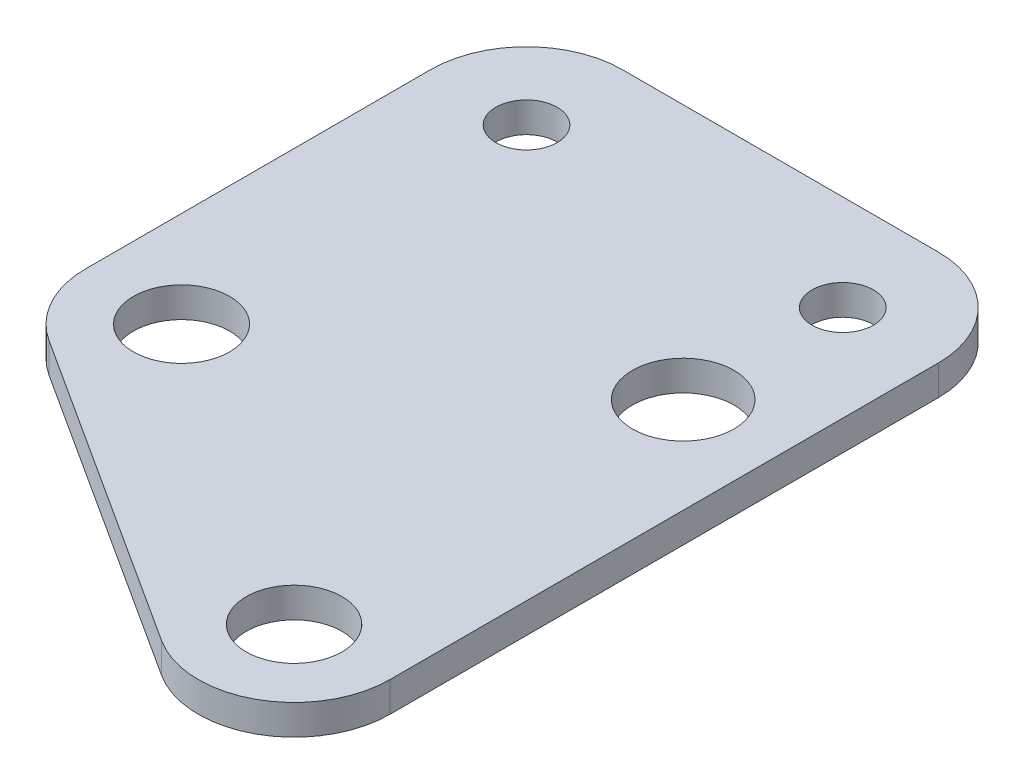
ISO-10303-21;
HEADER;
FILE_DESCRIPTION(('STEP AP214'),'2;1');
FILE_NAME('part.step','',(''),(''),'','','');
FILE_SCHEMA(('AUTOMOTIVE_DESIGN { 1 0 10303 214 1 1 1 1 }'));
ENDSEC;
DATA;
#1=APPLICATION_CONTEXT('core data for automotive mechanical design processes');
#2=APPLICATION_PROTOCOL_DEFINITION('international standard','automotive_design',2000,#1);
#3=PRODUCT_CONTEXT('',#1,'mechanical');
#4=PRODUCT('Part','Part','',(#3));
#5=PRODUCT_RELATED_PRODUCT_CATEGORY('part','',(#4));
#6=PRODUCT_DEFINITION_FORMATION('','',#4);
#7=PRODUCT_DEFINITION_CONTEXT('part definition',#1,'design');
#8=PRODUCT_DEFINITION('design','',#6,#7);
#9=PRODUCT_DEFINITION_SHAPE('','',#8);
#10=(LENGTH_UNIT() NAMED_UNIT(*) SI_UNIT(.MILLI.,.METRE.));
#11=(NAMED_UNIT(*) PLANE_ANGLE_UNIT() SI_UNIT($,.RADIAN.));
#12=(NAMED_UNIT(*) SI_UNIT($,.STERADIAN.) SOLID_ANGLE_UNIT());
#13=UNCERTAINTY_MEASURE_WITH_UNIT(LENGTH_MEASURE(1.E-05),#10,'distance_accuracy_value','');
#14=(GEOMETRIC_REPRESENTATION_CONTEXT(3) GLOBAL_UNCERTAINTY_ASSIGNED_CONTEXT((#13)) GLOBAL_UNIT_ASSIGNED_CONTEXT((#10,
#11,#12)) REPRESENTATION_CONTEXT('',''));
#15=CARTESIAN_POINT('',(0.,0.,0.));
#16=DIRECTION('',(0.,0.,1.));
#17=DIRECTION('',(1.,0.,0.));
#18=AXIS2_PLACEMENT_3D('',#15,#16,#17);
#19=CARTESIAN_POINT('',(0.,1.56999999999996,0.));
#20=DIRECTION('',(0.,-1.,0.));
#21=DIRECTION('',(1.,0.,0.));
#22=AXIS2_PLACEMENT_3D('',#19,#20,#21);
#23=PLANE('',#22);
#24=CARTESIAN_POINT('',(21.4999999999999,1.57000000000018,13.325));
#25=DIRECTION('',(0.,-1.,0.));
#26=DIRECTION('',(1.,0.,0.));
#27=AXIS2_PLACEMENT_3D('',#24,#25,#26);
#28=CIRCLE('',#27,2.65);
#29=CARTESIAN_POINT('',(24.1499999999999,1.57000000000018,13.325));
#30=VERTEX_POINT('',#29);
#31=EDGE_CURVE('E145',#30,#30,#28,.T.);
#32=ORIENTED_EDGE('',*,*,#31,.T.);
#33=EDGE_LOOP('',(#32));
#34=FACE_BOUND('',#33,.T.);
#35=CARTESIAN_POINT('',(4.99999999999978,1.57000000000007,5.00000000000006));
#36=DIRECTION('',(0.,-1.,0.));
#37=DIRECTION('',(1.,0.,0.));
#38=AXIS2_PLACEMENT_3D('',#35,#36,#37);
#39=CIRCLE('',#38,1.6);
#40=CARTESIAN_POINT('',(6.59999999999978,1.57000000000007,5.00000000000006));
#41=VERTEX_POINT('',#40);
#42=EDGE_CURVE('E19',#41,#41,#39,.T.);
#43=ORIENTED_EDGE('',*,*,#42,.T.);
#44=EDGE_LOOP('',(#43));
#45=FACE_BOUND('',#44,.T.);
#46=CARTESIAN_POINT('',(21.4999999999997,1.57000000000018,5.00000000000006));
#47=DIRECTION('',(0.,-1.,0.));
#48=DIRECTION('',(1.,0.,0.));
#49=AXIS2_PLACEMENT_3D('',#46,#47,#48);
#50=CIRCLE('',#49,1.6);
#51=CARTESIAN_POINT('',(23.0999999999997,1.57000000000018,5.00000000000006));
#52=VERTEX_POINT('',#51);
#53=EDGE_CURVE('E148',#52,#52,#50,.T.);
#54=ORIENTED_EDGE('',*,*,#53,.T.);
#55=EDGE_LOOP('',(#54));
#56=FACE_BOUND('',#55,.T.);
#57=CARTESIAN_POINT('',(4.99999999999978,1.57000000000007,23.0000000000001));
#58=DIRECTION('',(0.,-1.,0.));
#59=DIRECTION('',(1.,0.,0.));
#60=AXIS2_PLACEMENT_3D('',#57,#58,#59);
#61=CIRCLE('',#60,2.51);
#62=CARTESIAN_POINT('',(7.50999999999978,1.57000000000007,23.0000000000001));
#63=VERTEX_POINT('',#62);
#64=EDGE_CURVE('E115',#63,#63,#61,.T.);
#65=ORIENTED_EDGE('',*,*,#64,.T.);
#66=EDGE_LOOP('',(#65));
#67=FACE_BOUND('',#66,.T.);
#68=CARTESIAN_POINT('',(21.4999999999998,1.57000000000018,33.6250000000001));
#69=DIRECTION('',(0.,-1.,0.));
#70=DIRECTION('',(1.,0.,0.));
#71=AXIS2_PLACEMENT_3D('',#68,#69,#70);
#72=CIRCLE('',#71,2.5);
#73=CARTESIAN_POINT('',(23.9999999999998,1.57000000000018,33.6250000000001));
#74=VERTEX_POINT('',#73);
#75=EDGE_CURVE('E151',#74,#74,#72,.T.);
#76=ORIENTED_EDGE('',*,*,#75,.T.);
#77=EDGE_LOOP('',(#76));
#78=FACE_BOUND('',#77,.T.);
#79=CARTESIAN_POINT('',(21.4999999999998,1.57000000000018,5.00000000000006));
#80=DIRECTION('',(0.,-1.,0.));
#81=DIRECTION('',(1.,0.,0.));
#82=AXIS2_PLACEMENT_3D('',#79,#80,#81);
#83=CIRCLE('',#82,5.);
#84=CARTESIAN_POINT('',(21.4999999999998,1.57000000000018,0.));
#85=VERTEX_POINT('',#84);
#86=CARTESIAN_POINT('',(26.4999999999999,1.57000000000007,5.00000000000003));
#87=VERTEX_POINT('',#86);
#88=EDGE_CURVE('E79',#85,#87,#83,.T.);
#89=ORIENTED_EDGE('',*,*,#88,.F.);
#90=DIRECTION('',(1.,0.,0.));
#91=VECTOR('',#90,1.);
#92=CARTESIAN_POINT('',(0.,1.57000000000018,0.));
#93=LINE('',#92,#91);
#94=CARTESIAN_POINT('',(4.99999999999989,1.57000000000007,0.));
#95=VERTEX_POINT('',#94);
#96=EDGE_CURVE('E96',#85,#95,#93,.F.);
#97=ORIENTED_EDGE('',*,*,#96,.T.);
#98=CARTESIAN_POINT('',(4.99999999999978,1.56999999999996,5.00000000000006));
#99=DIRECTION('',(0.,-1.,0.));
#100=DIRECTION('',(1.,0.,0.));
#101=AXIS2_PLACEMENT_3D('',#98,#99,#100);
#102=CIRCLE('',#101,5.);
#103=CARTESIAN_POINT('',(-2.1987620058006E-13,1.56999999999996,5.00000000000005));
#104=VERTEX_POINT('',#103);
#105=EDGE_CURVE('E112',#104,#95,#102,.T.);
#106=ORIENTED_EDGE('',*,*,#105,.F.);
#107=DIRECTION('',(0.,0.,-1.));
#108=VECTOR('',#107,1.);
#109=CARTESIAN_POINT('',(-2.22044604925031E-13,1.56999999999996,25.7272727272728));
#110=LINE('',#109,#108);
#111=CARTESIAN_POINT('',(-2.21858910662035E-13,1.56999999999996,23.0000000000001));
#112=VERTEX_POINT('',#111);
#113=EDGE_CURVE('E109',#104,#112,#110,.F.);
#114=ORIENTED_EDGE('',*,*,#113,.T.);
#115=CARTESIAN_POINT('',(4.99999999999978,1.56999999999996,23.0000000000001));
#116=DIRECTION('',(0.,-1.,0.));
#117=DIRECTION('',(1.,0.,0.));
#118=AXIS2_PLACEMENT_3D('',#115,#116,#117);
#119=CIRCLE('',#118,5.);
#120=CARTESIAN_POINT('',(2.2929936305731,1.56999999999996,27.2038216560511));
#121=VERTEX_POINT('',#120);
#122=EDGE_CURVE('E117',#121,#112,#119,.T.);
#123=ORIENTED_EDGE('',*,*,#122,.F.);
#124=DIRECTION('',(-0.840764331210191,0.,-0.54140127388535));
#125=VECTOR('',#124,1.);
#126=CARTESIAN_POINT('',(26.4999999999998,1.56999999999996,42.7916666666667));
#127=LINE('',#126,#125);
#128=CARTESIAN_POINT('',(18.792993630573,1.56999999999996,37.828821656051));
#129=VERTEX_POINT('',#128);
#130=EDGE_CURVE('E116',#121,#129,#127,.F.);
#131=ORIENTED_EDGE('',*,*,#130,.T.);
#132=CARTESIAN_POINT('',(21.4999999999998,1.56999999999996,33.6250000000001));
#133=DIRECTION('',(0.,-1.,0.));
#134=DIRECTION('',(1.,0.,0.));
#135=AXIS2_PLACEMENT_3D('',#132,#133,#134);
#136=CIRCLE('',#135,5.);
#137=CARTESIAN_POINT('',(26.4999999999998,1.56999999999996,33.6250000000001));
#138=VERTEX_POINT('',#137);
#139=EDGE_CURVE('E84',#138,#129,#136,.T.);
#140=ORIENTED_EDGE('',*,*,#139,.F.);
#141=DIRECTION('',(0.,0.,1.));
#142=VECTOR('',#141,1.);
#143=CARTESIAN_POINT('',(26.4999999999999,1.56999999999996,0.));
#144=LINE('',#143,#142);
#145=EDGE_CURVE('E82',#138,#87,#144,.F.);
#146=ORIENTED_EDGE('',*,*,#145,.T.);
#147=EDGE_LOOP('',(#89,#97,#106,#114,#123,#131,#140,#146));
#148=FACE_BOUND('',#147,.T.);
#149=ADVANCED_FACE('F16',(#34,#45,#56,#67,#78,#148),#23,.F.);
#150=CARTESIAN_POINT('',(4.99999999999978,1.57000000000007,5.00000000000006));
#151=DIRECTION('',(0.,-1.,0.));
#152=DIRECTION('',(1.,0.,0.));
#153=AXIS2_PLACEMENT_3D('',#150,#151,#152);
#154=CYLINDRICAL_SURFACE('',#153,1.6);
#155=ORIENTED_EDGE('',*,*,#42,.F.);
#156=EDGE_LOOP('',(#155));
#157=FACE_BOUND('',#156,.T.);
#158=CARTESIAN_POINT('',(4.99999999999978,0.,5.00000000000006));
#159=DIRECTION('',(0.,-1.,0.));
#160=DIRECTION('',(1.,0.,0.));
#161=AXIS2_PLACEMENT_3D('',#158,#159,#160);
#162=CIRCLE('',#161,1.6);
#163=CARTESIAN_POINT('',(6.59999999999978,0.,5.00000000000006));
#164=VERTEX_POINT('',#163);
#165=EDGE_CURVE('E142',#164,#164,#162,.F.);
#166=ORIENTED_EDGE('',*,*,#165,.F.);
#167=EDGE_LOOP('',(#166));
#168=FACE_BOUND('',#167,.T.);
#169=ADVANCED_FACE('F166',(#157,#168),#154,.F.);
#170=CARTESIAN_POINT('',(4.99999999999978,1.57000000000007,23.0000000000001));
#171=DIRECTION('',(0.,-1.,0.));
#172=DIRECTION('',(1.,0.,0.));
#173=AXIS2_PLACEMENT_3D('',#170,#171,#172);
#174=CYLINDRICAL_SURFACE('',#173,2.51);
#175=ORIENTED_EDGE('',*,*,#64,.F.);
#176=EDGE_LOOP('',(#175));
#177=FACE_BOUND('',#176,.T.);
#178=CARTESIAN_POINT('',(4.99999999999978,0.,23.0000000000001));
#179=DIRECTION('',(0.,-1.,0.));
#180=DIRECTION('',(1.,0.,0.));
#181=AXIS2_PLACEMENT_3D('',#178,#179,#180);
#182=CIRCLE('',#181,2.51);
#183=CARTESIAN_POINT('',(7.50999999999978,0.,23.0000000000001));
#184=VERTEX_POINT('',#183);
#185=EDGE_CURVE('E139',#184,#184,#182,.F.);
#186=ORIENTED_EDGE('',*,*,#185,.F.);
#187=EDGE_LOOP('',(#186));
#188=FACE_BOUND('',#187,.T.);
#189=ADVANCED_FACE('F169',(#177,#188),#174,.F.);
#190=CARTESIAN_POINT('',(0.,1.56999999999996,0.));
#191=DIRECTION('',(0.,0.,1.));
#192=DIRECTION('',(1.,0.,0.));
#193=AXIS2_PLACEMENT_3D('',#190,#191,#192);
#194=PLANE('',#193);
#195=DIRECTION('',(0.,-1.,0.));
#196=VECTOR('',#195,1.);
#197=CARTESIAN_POINT('',(21.4999999999998,1.57000000000018,0.));
#198=LINE('',#197,#196);
#199=CARTESIAN_POINT('',(21.4999999999998,0.,0.));
#200=VERTEX_POINT('',#199);
#201=EDGE_CURVE('E89',#200,#85,#198,.F.);
#202=ORIENTED_EDGE('',*,*,#201,.F.);
#203=DIRECTION('',(1.,0.,0.));
#204=VECTOR('',#203,1.);
#205=CARTESIAN_POINT('',(0.,0.,0.));
#206=LINE('',#205,#204);
#207=CARTESIAN_POINT('',(4.99999999999989,0.,0.));
#208=VERTEX_POINT('',#207);
#209=EDGE_CURVE('E138',#208,#200,#206,.T.);
#210=ORIENTED_EDGE('',*,*,#209,.F.);
#211=DIRECTION('',(0.,-1.,0.));
#212=VECTOR('',#211,1.);
#213=CARTESIAN_POINT('',(5.,1.57000000000007,0.));
#214=LINE('',#213,#212);
#215=EDGE_CURVE('E156',#95,#208,#214,.T.);
#216=ORIENTED_EDGE('',*,*,#215,.F.);
#217=ORIENTED_EDGE('',*,*,#96,.F.);
#218=EDGE_LOOP('',(#202,#210,#216,#217));
#219=FACE_BOUND('',#218,.T.);
#220=ADVANCED_FACE('F216',(#219),#194,.F.);
#221=CARTESIAN_POINT('',(21.4999999999998,1.57000000000018,5.00000000000006));
#222=DIRECTION('',(0.,-1.,0.));
#223=DIRECTION('',(1.,0.,0.));
#224=AXIS2_PLACEMENT_3D('',#221,#222,#223);
#225=CYLINDRICAL_SURFACE('',#224,5.);
#226=CARTESIAN_POINT('',(21.4999999999998,0.,5.00000000000006));
#227=DIRECTION('',(0.,-1.,0.));
#228=DIRECTION('',(1.,0.,0.));
#229=AXIS2_PLACEMENT_3D('',#226,#227,#228);
#230=CIRCLE('',#229,5.);
#231=CARTESIAN_POINT('',(26.4999999999998,0.,5.00000000000003));
#232=VERTEX_POINT('',#231);
#233=EDGE_CURVE('E136',#200,#232,#230,.T.);
#234=ORIENTED_EDGE('',*,*,#233,.F.);
#235=ORIENTED_EDGE('',*,*,#201,.T.);
#236=ORIENTED_EDGE('',*,*,#88,.T.);
#237=DIRECTION('',(0.,1.,0.));
#238=VECTOR('',#237,1.);
#239=CARTESIAN_POINT('',(26.4999999999999,1.56999999999996,5.));
#240=LINE('',#239,#238);
#241=EDGE_CURVE('E88',#87,#232,#240,.F.);
#242=ORIENTED_EDGE('',*,*,#241,.T.);
#243=EDGE_LOOP('',(#234,#235,#236,#242));
#244=FACE_BOUND('',#243,.T.);
#245=ADVANCED_FACE('F94',(#244),#225,.T.);
#246=CARTESIAN_POINT('',(26.4999999999999,1.56999999999996,0.));
#247=DIRECTION('',(-1.,0.,0.));
#248=DIRECTION('',(0.,0.,1.));
#249=AXIS2_PLACEMENT_3D('',#246,#247,#248);
#250=PLANE('',#249);
#251=ORIENTED_EDGE('',*,*,#241,.F.);
#252=ORIENTED_EDGE('',*,*,#145,.F.);
#253=DIRECTION('',(0.,-1.,0.));
#254=VECTOR('',#253,1.);
#255=CARTESIAN_POINT('',(26.4999999999998,1.57000000000018,33.6250000000001));
#256=LINE('',#255,#254);
#257=CARTESIAN_POINT('',(26.4999999999998,1.11022302462516E-13,33.6250000000001));
#258=VERTEX_POINT('',#257);
#259=EDGE_CURVE('E103',#258,#138,#256,.F.);
#260=ORIENTED_EDGE('',*,*,#259,.F.);
#261=DIRECTION('',(0.,0.,1.));
#262=VECTOR('',#261,1.);
#263=CARTESIAN_POINT('',(26.4999999999998,0.,0.));
#264=LINE('',#263,#262);
#265=EDGE_CURVE('E100',#232,#258,#264,.T.);
#266=ORIENTED_EDGE('',*,*,#265,.F.);
#267=EDGE_LOOP('',(#251,#252,#260,#266));
#268=FACE_BOUND('',#267,.T.);
#269=ADVANCED_FACE('F98',(#268),#250,.F.);
#270=CARTESIAN_POINT('',(21.4999999999998,1.57000000000018,33.6250000000001));
#271=DIRECTION('',(0.,-1.,0.));
#272=DIRECTION('',(1.,0.,0.));
#273=AXIS2_PLACEMENT_3D('',#270,#271,#272);
#274=CYLINDRICAL_SURFACE('',#273,5.);
#275=CARTESIAN_POINT('',(21.4999999999998,2.22044604925031E-13,33.6250000000001));
#276=DIRECTION('',(0.,-1.,0.));
#277=DIRECTION('',(1.,0.,0.));
#278=AXIS2_PLACEMENT_3D('',#275,#276,#277);
#279=CIRCLE('',#278,5.);
#280=CARTESIAN_POINT('',(18.792993630573,1.11022302462516E-13,37.828821656051));
#281=VERTEX_POINT('',#280);
#282=EDGE_CURVE('E133',#258,#281,#279,.T.);
#283=ORIENTED_EDGE('',*,*,#282,.F.);
#284=ORIENTED_EDGE('',*,*,#259,.T.);
#285=ORIENTED_EDGE('',*,*,#139,.T.);
#286=DIRECTION('',(0.,1.,0.));
#287=VECTOR('',#286,1.);
#288=CARTESIAN_POINT('',(18.792993630573,1.56999999999996,37.828821656051));
#289=LINE('',#288,#287);
#290=EDGE_CURVE('E118',#129,#281,#289,.F.);
#291=ORIENTED_EDGE('',*,*,#290,.T.);
#292=EDGE_LOOP('',(#283,#284,#285,#291));
#293=FACE_BOUND('',#292,.T.);
#294=ADVANCED_FACE('F207',(#293),#274,.T.);
#295=CARTESIAN_POINT('',(26.4999999999998,1.56999999999996,42.7916666666667));
#296=DIRECTION('',(0.54140127388535,0.,-0.840764331210191));
#297=DIRECTION('',(-0.840764331210191,0.,-0.54140127388535));
#298=AXIS2_PLACEMENT_3D('',#295,#296,#297);
#299=PLANE('',#298);
#300=DIRECTION('',(0.,-1.,0.));
#301=VECTOR('',#300,1.);
#302=CARTESIAN_POINT('',(2.29299363057317,1.57000000000007,27.2038216560511));
#303=LINE('',#302,#301);
#304=CARTESIAN_POINT('',(2.29299363057312,0.,27.203821656051));
#305=VERTEX_POINT('',#304);
#306=EDGE_CURVE('E157',#305,#121,#303,.F.);
#307=ORIENTED_EDGE('',*,*,#306,.F.);
#308=DIRECTION('',(-0.840764331210189,0.,-0.541401273885354));
#309=VECTOR('',#308,1.);
#310=CARTESIAN_POINT('',(18.792993630573,0.,37.828821656051));
#311=LINE('',#310,#309);
#312=EDGE_CURVE('E132',#281,#305,#311,.T.);
#313=ORIENTED_EDGE('',*,*,#312,.F.);
#314=ORIENTED_EDGE('',*,*,#290,.F.);
#315=ORIENTED_EDGE('',*,*,#130,.F.);
#316=EDGE_LOOP('',(#307,#313,#314,#315));
#317=FACE_BOUND('',#316,.T.);
#318=ADVANCED_FACE('F203',(#317),#299,.F.);
#319=CARTESIAN_POINT('',(4.99999999999978,1.57000000000007,23.0000000000001));
#320=DIRECTION('',(0.,-1.,0.));
#321=DIRECTION('',(1.,0.,0.));
#322=AXIS2_PLACEMENT_3D('',#319,#320,#321);
#323=CYLINDRICAL_SURFACE('',#322,5.);
#324=CARTESIAN_POINT('',(4.99999999999978,0.,23.0000000000001));
#325=DIRECTION('',(0.,-1.,0.));
#326=DIRECTION('',(1.,0.,0.));
#327=AXIS2_PLACEMENT_3D('',#324,#325,#326);
#328=CIRCLE('',#327,5.);
#329=CARTESIAN_POINT('',(-2.21951757793533E-13,0.,23.0000000000001));
#330=VERTEX_POINT('',#329);
#331=EDGE_CURVE('E129',#305,#330,#328,.T.);
#332=ORIENTED_EDGE('',*,*,#331,.F.);
#333=ORIENTED_EDGE('',*,*,#306,.T.);
#334=ORIENTED_EDGE('',*,*,#122,.T.);
#335=DIRECTION('',(0.,1.,0.));
#336=VECTOR('',#335,1.);
#337=CARTESIAN_POINT('',(-2.21673216399038E-13,1.56999999999996,23.0000000000001));
#338=LINE('',#337,#336);
#339=EDGE_CURVE('E113',#112,#330,#338,.F.);
#340=ORIENTED_EDGE('',*,*,#339,.T.);
#341=EDGE_LOOP('',(#332,#333,#334,#340));
#342=FACE_BOUND('',#341,.T.);
#343=ADVANCED_FACE('F200',(#342),#323,.T.);
#344=CARTESIAN_POINT('',(-2.22044604925031E-13,1.56999999999996,25.7272727272728));
#345=DIRECTION('',(1.,0.,0.));
#346=DIRECTION('',(0.,0.,-1.));
#347=AXIS2_PLACEMENT_3D('',#344,#345,#346);
#348=PLANE('',#347);
#349=DIRECTION('',(0.,-1.,0.));
#350=VECTOR('',#349,1.);
#351=CARTESIAN_POINT('',(-2.20309881449055E-13,1.57000000000007,5.00000000000003));
#352=LINE('',#351,#350);
#353=CARTESIAN_POINT('',(-2.21177243187043E-13,0.,5.00000000000005));
#354=VERTEX_POINT('',#353);
#355=EDGE_CURVE('E34',#354,#104,#352,.F.);
#356=ORIENTED_EDGE('',*,*,#355,.F.);
#357=DIRECTION('',(0.,0.,1.));
#358=VECTOR('',#357,1.);
#359=CARTESIAN_POINT('',(-2.22044604925031E-13,0.,0.));
#360=LINE('',#359,#358);
#361=EDGE_CURVE('E128',#330,#354,#360,.F.);
#362=ORIENTED_EDGE('',*,*,#361,.F.);
#363=ORIENTED_EDGE('',*,*,#339,.F.);
#364=ORIENTED_EDGE('',*,*,#113,.F.);
#365=EDGE_LOOP('',(#356,#362,#363,#364));
#366=FACE_BOUND('',#365,.T.);
#367=ADVANCED_FACE('F196',(#366),#348,.F.);
#368=CARTESIAN_POINT('',(4.99999999999978,1.57000000000007,5.00000000000006));
#369=DIRECTION('',(0.,-1.,0.));
#370=DIRECTION('',(1.,0.,0.));
#371=AXIS2_PLACEMENT_3D('',#368,#369,#370);
#372=CYLINDRICAL_SURFACE('',#371,5.);
#373=CARTESIAN_POINT('',(4.99999999999978,0.,5.00000000000006));
#374=DIRECTION('',(0.,-1.,0.));
#375=DIRECTION('',(1.,0.,0.));
#376=AXIS2_PLACEMENT_3D('',#373,#374,#375);
#377=CIRCLE('',#376,5.);
#378=EDGE_CURVE('E125',#354,#208,#377,.T.);
#379=ORIENTED_EDGE('',*,*,#378,.F.);
#380=ORIENTED_EDGE('',*,*,#355,.T.);
#381=ORIENTED_EDGE('',*,*,#105,.T.);
#382=ORIENTED_EDGE('',*,*,#215,.T.);
#383=EDGE_LOOP('',(#379,#380,#381,#382));
#384=FACE_BOUND('',#383,.T.);
#385=ADVANCED_FACE('F192',(#384),#372,.T.);
#386=CARTESIAN_POINT('',(21.4999999999998,1.57000000000018,33.6250000000001));
#387=DIRECTION('',(0.,-1.,0.));
#388=DIRECTION('',(1.,0.,0.));
#389=AXIS2_PLACEMENT_3D('',#386,#387,#388);
#390=CYLINDRICAL_SURFACE('',#389,2.5);
#391=ORIENTED_EDGE('',*,*,#75,.F.);
#392=EDGE_LOOP('',(#391));
#393=FACE_BOUND('',#392,.T.);
#394=CARTESIAN_POINT('',(21.4999999999998,2.22044604925031E-13,33.6250000000001));
#395=DIRECTION('',(0.,-1.,0.));
#396=DIRECTION('',(1.,0.,0.));
#397=AXIS2_PLACEMENT_3D('',#394,#395,#396);
#398=CIRCLE('',#397,2.5);
#399=CARTESIAN_POINT('',(23.9999999999998,2.22044604925031E-13,33.6250000000001));
#400=VERTEX_POINT('',#399);
#401=EDGE_CURVE('E122',#400,#400,#398,.F.);
#402=ORIENTED_EDGE('',*,*,#401,.F.);
#403=EDGE_LOOP('',(#402));
#404=FACE_BOUND('',#403,.T.);
#405=ADVANCED_FACE('F188',(#393,#404),#390,.F.);
#406=CARTESIAN_POINT('',(21.4999999999997,1.57000000000018,5.00000000000006));
#407=DIRECTION('',(0.,-1.,0.));
#408=DIRECTION('',(1.,0.,0.));
#409=AXIS2_PLACEMENT_3D('',#406,#407,#408);
#410=CYLINDRICAL_SURFACE('',#409,1.6);
#411=ORIENTED_EDGE('',*,*,#53,.F.);
#412=EDGE_LOOP('',(#411));
#413=FACE_BOUND('',#412,.T.);
#414=CARTESIAN_POINT('',(21.4999999999997,2.22044604925031E-13,5.00000000000006));
#415=DIRECTION('',(0.,-1.,0.));
#416=DIRECTION('',(1.,0.,0.));
#417=AXIS2_PLACEMENT_3D('',#414,#415,#416);
#418=CIRCLE('',#417,1.6);
#419=CARTESIAN_POINT('',(23.0999999999997,2.22044604925031E-13,5.00000000000006));
#420=VERTEX_POINT('',#419);
#421=EDGE_CURVE('E25',#420,#420,#418,.F.);
#422=ORIENTED_EDGE('',*,*,#421,.F.);
#423=EDGE_LOOP('',(#422));
#424=FACE_BOUND('',#423,.T.);
#425=ADVANCED_FACE('F181',(#413,#424),#410,.F.);
#426=CARTESIAN_POINT('',(21.4999999999999,1.57000000000018,13.325));
#427=DIRECTION('',(0.,-1.,0.));
#428=DIRECTION('',(1.,0.,0.));
#429=AXIS2_PLACEMENT_3D('',#426,#427,#428);
#430=CYLINDRICAL_SURFACE('',#429,2.65);
#431=ORIENTED_EDGE('',*,*,#31,.F.);
#432=EDGE_LOOP('',(#431));
#433=FACE_BOUND('',#432,.T.);
#434=CARTESIAN_POINT('',(21.4999999999999,2.22044604925031E-13,13.325));
#435=DIRECTION('',(0.,-1.,0.));
#436=DIRECTION('',(1.,0.,0.));
#437=AXIS2_PLACEMENT_3D('',#434,#435,#436);
#438=CIRCLE('',#437,2.65);
#439=CARTESIAN_POINT('',(24.1499999999999,2.22044604925031E-13,13.325));
#440=VERTEX_POINT('',#439);
#441=EDGE_CURVE('E11',#440,#440,#438,.F.);
#442=ORIENTED_EDGE('',*,*,#441,.F.);
#443=EDGE_LOOP('',(#442));
#444=FACE_BOUND('',#443,.T.);
#445=ADVANCED_FACE('F174',(#433,#444),#430,.F.);
#446=CARTESIAN_POINT('',(0.,0.,0.));
#447=DIRECTION('',(0.,-1.,0.));
#448=DIRECTION('',(1.,0.,0.));
#449=AXIS2_PLACEMENT_3D('',#446,#447,#448);
#450=PLANE('',#449);
#451=ORIENTED_EDGE('',*,*,#441,.T.);
#452=EDGE_LOOP('',(#451));
#453=FACE_BOUND('',#452,.T.);
#454=ORIENTED_EDGE('',*,*,#421,.T.);
#455=EDGE_LOOP('',(#454));
#456=FACE_BOUND('',#455,.T.);
#457=ORIENTED_EDGE('',*,*,#401,.T.);
#458=EDGE_LOOP('',(#457));
#459=FACE_BOUND('',#458,.T.);
#460=ORIENTED_EDGE('',*,*,#361,.T.);
#461=ORIENTED_EDGE('',*,*,#378,.T.);
#462=ORIENTED_EDGE('',*,*,#209,.T.);
#463=ORIENTED_EDGE('',*,*,#233,.T.);
#464=ORIENTED_EDGE('',*,*,#265,.T.);
#465=ORIENTED_EDGE('',*,*,#282,.T.);
#466=ORIENTED_EDGE('',*,*,#312,.T.);
#467=ORIENTED_EDGE('',*,*,#331,.T.);
#468=EDGE_LOOP('',(#460,#461,#462,#463,#464,#465,#466,#467));
#469=FACE_BOUND('',#468,.T.);
#470=ORIENTED_EDGE('',*,*,#185,.T.);
#471=EDGE_LOOP('',(#470));
#472=FACE_BOUND('',#471,.T.);
#473=ORIENTED_EDGE('',*,*,#165,.T.);
#474=EDGE_LOOP('',(#473));
#475=FACE_BOUND('',#474,.T.);
#476=ADVANCED_FACE('F172',(#453,#456,#459,#469,#472,#475),#450,.T.);
#477=CLOSED_SHELL('',(#149,#169,#189,#220,#245,#269,#294,#318,#343,#367,#385,#405,#425,#445,#476));
#478=MANIFOLD_SOLID_BREP('B1',#477);
#479=ADVANCED_BREP_SHAPE_REPRESENTATION('',(#18,#478),#14);
#480=SHAPE_DEFINITION_REPRESENTATION(#9,#479);
ENDSEC;
END-ISO-10303-21;
